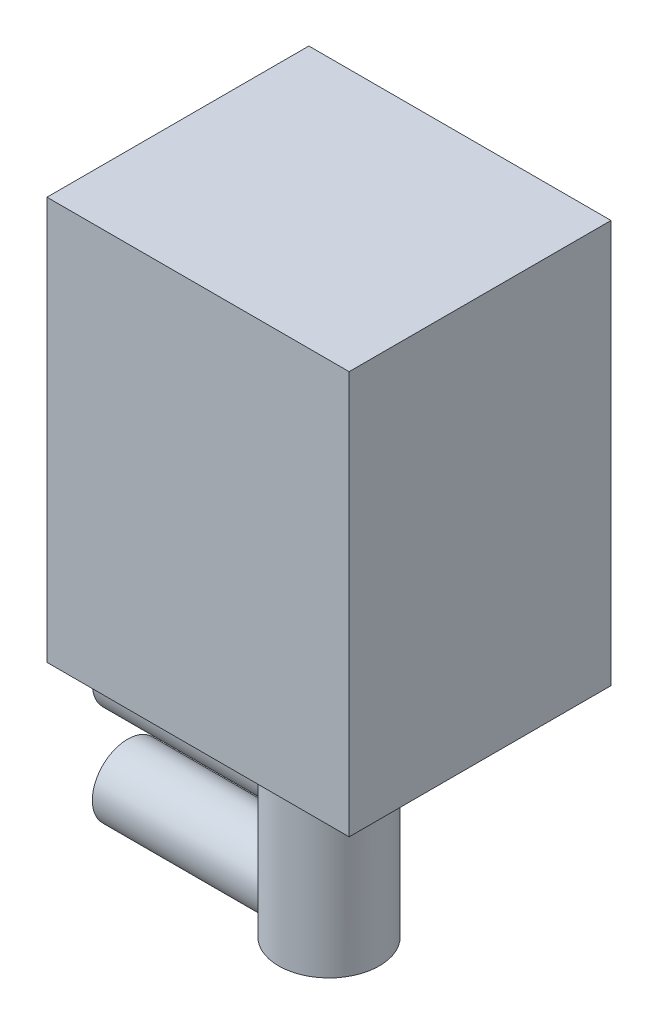
ISO-10303-21;
HEADER;
FILE_DESCRIPTION(('STEP AP214'),'2;1');
FILE_NAME('part.step','',(''),(''),'','','');
FILE_SCHEMA(('AUTOMOTIVE_DESIGN { 1 0 10303 214 1 1 1 1 }'));
ENDSEC;
DATA;
#1=APPLICATION_CONTEXT('core data for automotive mechanical design processes');
#2=APPLICATION_PROTOCOL_DEFINITION('international standard','automotive_design',2000,#1);
#3=PRODUCT_CONTEXT('',#1,'mechanical');
#4=PRODUCT('Part','Part','',(#3));
#5=PRODUCT_RELATED_PRODUCT_CATEGORY('part','',(#4));
#6=PRODUCT_DEFINITION_FORMATION('','',#4);
#7=PRODUCT_DEFINITION_CONTEXT('part definition',#1,'design');
#8=PRODUCT_DEFINITION('design','',#6,#7);
#9=PRODUCT_DEFINITION_SHAPE('','',#8);
#10=(LENGTH_UNIT() NAMED_UNIT(*) SI_UNIT(.MILLI.,.METRE.));
#11=(NAMED_UNIT(*) PLANE_ANGLE_UNIT() SI_UNIT($,.RADIAN.));
#12=(NAMED_UNIT(*) SI_UNIT($,.STERADIAN.) SOLID_ANGLE_UNIT());
#13=UNCERTAINTY_MEASURE_WITH_UNIT(LENGTH_MEASURE(1.E-05),#10,'distance_accuracy_value','');
#14=(GEOMETRIC_REPRESENTATION_CONTEXT(3) GLOBAL_UNCERTAINTY_ASSIGNED_CONTEXT((#13)) GLOBAL_UNIT_ASSIGNED_CONTEXT((#10,
#11,#12)) REPRESENTATION_CONTEXT('',''));
#15=CARTESIAN_POINT('',(0.,0.,0.));
#16=DIRECTION('',(0.,0.,1.));
#17=DIRECTION('',(1.,0.,0.));
#18=AXIS2_PLACEMENT_3D('',#15,#16,#17);
#19=CARTESIAN_POINT('',(0.,0.,13.));
#20=DIRECTION('',(0.,-1.,0.));
#21=DIRECTION('',(0.,0.,-1.));
#22=AXIS2_PLACEMENT_3D('',#19,#20,#21);
#23=PLANE('',#22);
#24=DIRECTION('',(-1.,0.,0.));
#25=VECTOR('',#24,1.);
#26=CARTESIAN_POINT('',(0.,0.,0.));
#27=LINE('',#26,#25);
#28=CARTESIAN_POINT('',(0.,0.,0.));
#29=VERTEX_POINT('',#28);
#30=CARTESIAN_POINT('',(-15.,0.,0.));
#31=VERTEX_POINT('',#30);
#32=EDGE_CURVE('E128',#29,#31,#27,.T.);
#33=ORIENTED_EDGE('',*,*,#32,.T.);
#34=DIRECTION('',(0.,0.,-1.));
#35=VECTOR('',#34,1.);
#36=CARTESIAN_POINT('',(-15.,0.,13.));
#37=LINE('',#36,#35);
#38=CARTESIAN_POINT('',(-15.,0.,13.));
#39=VERTEX_POINT('',#38);
#40=EDGE_CURVE('E59',#39,#31,#37,.T.);
#41=ORIENTED_EDGE('',*,*,#40,.F.);
#42=DIRECTION('',(-1.,0.,0.));
#43=VECTOR('',#42,1.);
#44=CARTESIAN_POINT('',(0.,0.,13.));
#45=LINE('',#44,#43);
#46=CARTESIAN_POINT('',(0.,0.,13.));
#47=VERTEX_POINT('',#46);
#48=EDGE_CURVE('E107',#47,#39,#45,.T.);
#49=ORIENTED_EDGE('',*,*,#48,.F.);
#50=DIRECTION('',(0.,0.,-1.));
#51=VECTOR('',#50,1.);
#52=CARTESIAN_POINT('',(0.,0.,13.));
#53=LINE('',#52,#51);
#54=EDGE_CURVE('E124',#47,#29,#53,.T.);
#55=ORIENTED_EDGE('',*,*,#54,.T.);
#56=EDGE_LOOP('',(#33,#41,#49,#55));
#57=FACE_BOUND('',#56,.T.);
#58=ADVANCED_FACE('F45',(#57),#23,.F.);
#59=CARTESIAN_POINT('',(-15.,0.,13.));
#60=DIRECTION('',(1.,0.,0.));
#61=DIRECTION('',(0.,1.,0.));
#62=AXIS2_PLACEMENT_3D('',#59,#60,#61);
#63=PLANE('',#62);
#64=DIRECTION('',(0.,-1.,0.));
#65=VECTOR('',#64,1.);
#66=CARTESIAN_POINT('',(-15.,0.,0.));
#67=LINE('',#66,#65);
#68=CARTESIAN_POINT('',(-15.,-20.,0.));
#69=VERTEX_POINT('',#68);
#70=EDGE_CURVE('E114',#31,#69,#67,.T.);
#71=ORIENTED_EDGE('',*,*,#70,.T.);
#72=DIRECTION('',(0.,0.,-1.));
#73=VECTOR('',#72,1.);
#74=CARTESIAN_POINT('',(-15.,-20.,13.));
#75=LINE('',#74,#73);
#76=CARTESIAN_POINT('',(-15.,-20.,13.));
#77=VERTEX_POINT('',#76);
#78=EDGE_CURVE('E112',#77,#69,#75,.T.);
#79=ORIENTED_EDGE('',*,*,#78,.F.);
#80=DIRECTION('',(0.,-1.,0.));
#81=VECTOR('',#80,1.);
#82=CARTESIAN_POINT('',(-15.,0.,13.));
#83=LINE('',#82,#81);
#84=EDGE_CURVE('E101',#39,#77,#83,.T.);
#85=ORIENTED_EDGE('',*,*,#84,.F.);
#86=ORIENTED_EDGE('',*,*,#40,.T.);
#87=EDGE_LOOP('',(#71,#79,#85,#86));
#88=FACE_BOUND('',#87,.T.);
#89=ADVANCED_FACE('F113',(#88),#63,.F.);
#90=CARTESIAN_POINT('',(0.,-20.,13.));
#91=DIRECTION('',(0.,1.,0.));
#92=DIRECTION('',(0.,0.,1.));
#93=AXIS2_PLACEMENT_3D('',#90,#91,#92);
#94=PLANE('',#93);
#95=CARTESIAN_POINT('',(-7.5,-20.,6.5));
#96=DIRECTION('',(0.,-1.,0.));
#97=DIRECTION('',(0.,0.,-1.));
#98=AXIS2_PLACEMENT_3D('',#95,#96,#97);
#99=CIRCLE('',#98,2.5);
#100=CARTESIAN_POINT('',(-7.5,-20.,4.));
#101=VERTEX_POINT('',#100);
#102=EDGE_CURVE('E11',#101,#101,#99,.T.);
#103=ORIENTED_EDGE('',*,*,#102,.F.);
#104=EDGE_LOOP('',(#103));
#105=FACE_BOUND('',#104,.T.);
#106=DIRECTION('',(1.,0.,0.));
#107=VECTOR('',#106,1.);
#108=CARTESIAN_POINT('',(0.,-20.,0.));
#109=LINE('',#108,#107);
#110=CARTESIAN_POINT('',(0.,-20.,0.));
#111=VERTEX_POINT('',#110);
#112=EDGE_CURVE('E135',#69,#111,#109,.T.);
#113=ORIENTED_EDGE('',*,*,#112,.T.);
#114=DIRECTION('',(0.,0.,-1.));
#115=VECTOR('',#114,1.);
#116=CARTESIAN_POINT('',(0.,-20.,13.));
#117=LINE('',#116,#115);
#118=CARTESIAN_POINT('',(0.,-20.,13.));
#119=VERTEX_POINT('',#118);
#120=EDGE_CURVE('E118',#119,#111,#117,.T.);
#121=ORIENTED_EDGE('',*,*,#120,.F.);
#122=DIRECTION('',(1.,0.,0.));
#123=VECTOR('',#122,1.);
#124=CARTESIAN_POINT('',(0.,-20.,13.));
#125=LINE('',#124,#123);
#126=EDGE_CURVE('E104',#77,#119,#125,.T.);
#127=ORIENTED_EDGE('',*,*,#126,.F.);
#128=ORIENTED_EDGE('',*,*,#78,.T.);
#129=EDGE_LOOP('',(#113,#121,#127,#128));
#130=FACE_BOUND('',#129,.T.);
#131=ADVANCED_FACE('F120',(#105,#130),#94,.F.);
#132=CARTESIAN_POINT('',(0.,0.,13.));
#133=DIRECTION('',(-1.,0.,0.));
#134=DIRECTION('',(0.,0.,1.));
#135=AXIS2_PLACEMENT_3D('',#132,#133,#134);
#136=PLANE('',#135);
#137=DIRECTION('',(0.,1.,0.));
#138=VECTOR('',#137,1.);
#139=CARTESIAN_POINT('',(0.,0.,0.));
#140=LINE('',#139,#138);
#141=EDGE_CURVE('E93',#111,#29,#140,.T.);
#142=ORIENTED_EDGE('',*,*,#141,.T.);
#143=ORIENTED_EDGE('',*,*,#54,.F.);
#144=DIRECTION('',(0.,1.,0.));
#145=VECTOR('',#144,1.);
#146=CARTESIAN_POINT('',(0.,0.,13.));
#147=LINE('',#146,#145);
#148=EDGE_CURVE('E73',#119,#47,#147,.T.);
#149=ORIENTED_EDGE('',*,*,#148,.F.);
#150=ORIENTED_EDGE('',*,*,#120,.T.);
#151=EDGE_LOOP('',(#142,#143,#149,#150));
#152=FACE_BOUND('',#151,.T.);
#153=ADVANCED_FACE('F148',(#152),#136,.F.);
#154=CARTESIAN_POINT('',(0.,0.,13.));
#155=DIRECTION('',(0.,0.,1.));
#156=DIRECTION('',(1.,0.,0.));
#157=AXIS2_PLACEMENT_3D('',#154,#155,#156);
#158=PLANE('',#157);
#159=ORIENTED_EDGE('',*,*,#48,.T.);
#160=ORIENTED_EDGE('',*,*,#84,.T.);
#161=ORIENTED_EDGE('',*,*,#126,.T.);
#162=ORIENTED_EDGE('',*,*,#148,.T.);
#163=EDGE_LOOP('',(#159,#160,#161,#162));
#164=FACE_BOUND('',#163,.T.);
#165=ADVANCED_FACE('F102',(#164),#158,.T.);
#166=CARTESIAN_POINT('',(0.,0.,0.));
#167=DIRECTION('',(0.,0.,1.));
#168=DIRECTION('',(1.,0.,0.));
#169=AXIS2_PLACEMENT_3D('',#166,#167,#168);
#170=PLANE('',#169);
#171=ORIENTED_EDGE('',*,*,#32,.F.);
#172=ORIENTED_EDGE('',*,*,#141,.F.);
#173=ORIENTED_EDGE('',*,*,#112,.F.);
#174=ORIENTED_EDGE('',*,*,#70,.F.);
#175=EDGE_LOOP('',(#171,#172,#173,#174));
#176=FACE_BOUND('',#175,.T.);
#177=ADVANCED_FACE('F147',(#176),#170,.F.);
#178=CARTESIAN_POINT('',(-7.5,-31.3,6.5));
#179=DIRECTION('',(0.,1.,0.));
#180=DIRECTION('',(0.,0.,1.));
#181=AXIS2_PLACEMENT_3D('',#178,#179,#180);
#182=CYLINDRICAL_SURFACE('',#181,2.5);
#183=CARTESIAN_POINT('',(-9.28535710713571,-24.55,4.75));
#184=CARTESIAN_POINT('',(-9.28536365232842,-24.4659990149189,4.75000331529756));
#185=CARTESIAN_POINT('',(-9.29140301018335,-24.3819795606854,4.75610478790581));
#186=CARTESIAN_POINT('',(-9.31428207856453,-24.217056162701,4.77993289424304));
#187=CARTESIAN_POINT('',(-9.33114580062352,-24.1361595703582,4.79768537521087));
#188=CARTESIAN_POINT('',(-9.37249938059928,-23.9804850639074,4.84329501332473));
#189=CARTESIAN_POINT('',(-9.39690320720833,-23.9056495767931,4.87103873541134));
#190=CARTESIAN_POINT('',(-9.45043473735259,-23.7618668245187,4.9355319573568));
#191=CARTESIAN_POINT('',(-9.47956276982564,-23.6929199698841,4.97228208440633));
#192=CARTESIAN_POINT('',(-9.54535102275824,-23.5496521862624,5.06121378337588));
#193=CARTESIAN_POINT('',(-9.58243700207531,-23.4765046006,5.11497070102416));
#194=CARTESIAN_POINT('',(-9.6564208214175,-23.3392196651729,5.23322154200872));
#195=CARTESIAN_POINT('',(-9.69331837146343,-23.2750935895146,5.29772868381858));
#196=CARTESIAN_POINT('',(-9.76996924261653,-23.1470343277908,5.4485562470379));
#197=CARTESIAN_POINT('',(-9.80917478390817,-23.084911850999,5.53672030976486));
#198=CARTESIAN_POINT('',(-9.87911884375226,-22.9769806528166,5.72549285513386));
#199=CARTESIAN_POINT('',(-9.90987426748605,-22.9311393050336,5.82607589919898));
#200=CARTESIAN_POINT('',(-9.95245937204221,-22.8685052913527,6.00835837879527));
#201=CARTESIAN_POINT('',(-9.96715488574729,-22.8472151002854,6.08785474580114));
#202=CARTESIAN_POINT('',(-9.9888153213972,-22.8159781422621,6.25005814684412));
#203=CARTESIAN_POINT('',(-9.99578641573295,-22.8060223181211,6.33276256262945));
#204=CARTESIAN_POINT('',(-10.0013889313169,-22.7980140881605,6.49919404690065));
#205=CARTESIAN_POINT('',(-10.0000041556763,-22.7999848005762,6.58292278736904));
#206=CARTESIAN_POINT('',(-9.98898580019574,-22.8157619395261,6.74870836762094));
#207=CARTESIAN_POINT('',(-9.97934992009681,-22.8295716665651,6.83076473464534));
#208=CARTESIAN_POINT('',(-9.95297594957067,-22.8678060123417,6.98909167896559));
#209=CARTESIAN_POINT('',(-9.93640494040199,-22.8919812213537,7.06545155447358));
#210=CARTESIAN_POINT('',(-9.8974241748025,-22.949813150594,7.21286612437319));
#211=CARTESIAN_POINT('',(-9.87501327141353,-22.9834717334672,7.28391977308835));
#212=CARTESIAN_POINT('',(-9.82302570425101,-23.0634017717464,7.42736494885482));
#213=CARTESIAN_POINT('',(-9.7929270864848,-23.1106648654039,7.49901153543619));
#214=CARTESIAN_POINT('',(-9.72936304366409,-23.214248105006,7.63380163072984));
#215=CARTESIAN_POINT('',(-9.6958940072484,-23.2705780054192,7.69693584549686));
#216=CARTESIAN_POINT('',(-9.6217040880619,-23.4021316304982,7.82466884852147));
#217=CARTESIAN_POINT('',(-9.58075557422617,-23.4789329950785,7.88751556001384));
#218=CARTESIAN_POINT('',(-9.50128404549408,-23.642924579626,7.99986258412797));
#219=CARTESIAN_POINT('',(-9.46276040583433,-23.7301121067378,8.04936634540833));
#220=CARTESIAN_POINT('',(-9.40133168615619,-23.8928609257998,8.12379387354891));
#221=CARTESIAN_POINT('',(-9.3768757262815,-23.9664379045021,8.1517550759101));
#222=CARTESIAN_POINT('',(-9.33530095032361,-24.1185469367905,8.19783359991294));
#223=CARTESIAN_POINT('',(-9.31816842537048,-24.1970694137189,8.21596933120924));
#224=CARTESIAN_POINT('',(-9.29384395713167,-24.3582900254054,8.2413948338882));
#225=CARTESIAN_POINT('',(-9.28675445152955,-24.4410223971969,8.24857289482399));
#226=CARTESIAN_POINT('',(-9.28434054379133,-24.6068290239285,8.2510385880738));
#227=CARTESIAN_POINT('',(-9.28901185251409,-24.6899031432021,8.24633055521636));
#228=CARTESIAN_POINT('',(-9.30768760487068,-24.8417906902261,8.22696239874667));
#229=CARTESIAN_POINT('',(-9.3203046319629,-24.9109813983149,8.21377642758929));
#230=CARTESIAN_POINT('',(-9.35179990244809,-25.0459618371618,8.179694996125));
#231=CARTESIAN_POINT('',(-9.37068474477724,-25.11174789867,8.15879140787065));
#232=CARTESIAN_POINT('',(-9.42274158237606,-25.2692296517999,8.09852896713014));
#233=CARTESIAN_POINT('',(-9.45845312500197,-25.3585319608095,8.05511505325273));
#234=CARTESIAN_POINT('',(-9.53399599544424,-25.5274271747067,7.9549264851744));
#235=CARTESIAN_POINT('',(-9.57383528916823,-25.6070006345115,7.89812571684052));
#236=CARTESIAN_POINT('',(-9.65418669583295,-25.7571042207913,7.7709251028698));
#237=CARTESIAN_POINT('',(-9.6946973173828,-25.8274353415547,7.70028884551029));
#238=CARTESIAN_POINT('',(-9.77185413151566,-25.9558614848155,7.54691346170575));
#239=CARTESIAN_POINT('',(-9.80850595042205,-26.0139744488824,7.46419238810028));
#240=CARTESIAN_POINT('',(-9.86919526820174,-26.1077685700709,7.30197297783225));
#241=CARTESIAN_POINT('',(-9.89431368424312,-26.1455551930822,7.22410182875262));
#242=CARTESIAN_POINT('',(-9.93747683045928,-26.2096252281767,7.06189989834058));
#243=CARTESIAN_POINT('',(-9.95552585079695,-26.2359156180433,6.97757307199189));
#244=CARTESIAN_POINT('',(-9.98300657254176,-26.275697273114,6.80402634864754));
#245=CARTESIAN_POINT('',(-9.9923884789659,-26.289114595737,6.71478126089729));
#246=CARTESIAN_POINT('',(-10.0013782796574,-26.3019749816737,6.53480553888199));
#247=CARTESIAN_POINT('',(-10.0009899864331,-26.3014234958682,6.44407549788398));
#248=CARTESIAN_POINT('',(-9.99101138192816,-26.2871405074315,6.27309185179121));
#249=CARTESIAN_POINT('',(-9.98231388173467,-26.2746877312971,6.19267308324698));
#250=CARTESIAN_POINT('',(-9.95773771003211,-26.2391238817133,6.03538762375546));
#251=CARTESIAN_POINT('',(-9.94185767243074,-26.2160107806925,5.95852161159616));
#252=CARTESIAN_POINT('',(-9.90344767867576,-26.1591967661347,5.80736995307969));
#253=CARTESIAN_POINT('',(-9.88070436495182,-26.1251534899162,5.73326887163356));
#254=CARTESIAN_POINT('',(-9.83039638985978,-26.0480322058968,5.59175958168727));
#255=CARTESIAN_POINT('',(-9.8028307960369,-26.0049524504459,5.52435267155708));
#256=CARTESIAN_POINT('',(-9.73999116004928,-25.9034754607884,5.38689475395307));
#257=CARTESIAN_POINT('',(-9.70418577912312,-25.8437363820568,5.31807867742173));
#258=CARTESIAN_POINT('',(-9.63102660052163,-25.7147319173632,5.1907501770447));
#259=CARTESIAN_POINT('',(-9.59366969893854,-25.6454467223589,5.13225977115243));
#260=CARTESIAN_POINT('',(-9.51471303450109,-25.4865279944988,5.01795288106144));
#261=CARTESIAN_POINT('',(-9.4733701022534,-25.395407992497,4.96400396927106));
#262=CARTESIAN_POINT('',(-9.39871813385105,-25.2022794940823,4.872622418089));
#263=CARTESIAN_POINT('',(-9.36538488501279,-25.1003051933291,4.83513971060891));
#264=CARTESIAN_POINT('',(-9.32254477153272,-24.9227346912676,4.78857220570044));
#265=CARTESIAN_POINT('',(-9.30880418551828,-24.8495615086463,4.77419594141868));
#266=CARTESIAN_POINT('',(-9.29021518690061,-24.7009276967234,4.75491663148513));
#267=CARTESIAN_POINT('',(-9.28535122655919,-24.6254713027482,4.74999702134653));
#268=CARTESIAN_POINT('',(-9.28535710713571,-24.55,4.75));
#269=B_SPLINE_CURVE_WITH_KNOTS('',3,(#183,#184,#185,#186,#187,#188,#189,#190,#191,#192,#193,
#194,#195,#196,#197,#198,#199,#200,#201,#202,#203,#204,#205,#206,#207,#208,#209,#210,#211,#212,
#213,#214,#215,#216,#217,#218,#219,#220,#221,#222,#223,#224,#225,#226,#227,#228,#229,#230,#231,
#232,#233,#234,#235,#236,#237,#238,#239,#240,#241,#242,#243,#244,#245,#246,#247,#248,#249,#250,
#251,#252,#253,#254,#255,#256,#257,#258,#259,#260,#261,#262,#263,#264,#265,#266,#267,#268),
.UNSPECIFIED.,.T.,.F.,(4,2,2,2,2,2,2,2,2,2,2,2,2,2,2,2,2,2,2,2,2,2,2,2,2,2,2,2,2,2,2,2,2,2,2,2,
2,2,2,2,2,2,4),(0.,0.251644352862943,0.503848863092813,0.753275865950745,1.00272024341801,
1.29584807815702,1.58933903876421,1.93170814842452,2.27338724778376,2.52311133695241,
2.77263573360097,3.02264395964274,3.27272190616391,3.51709337531477,3.76151287536607,
4.03336573621144,4.30551304756613,4.62626324788577,4.94693046648402,5.19332741197632,
5.43926108098983,5.68768561592647,5.93601956414821,6.14983844698567,6.36388316239659,
6.67875939439456,6.99425502444262,7.31570467879083,7.63667895652621,7.90595122268596,
8.17505982302552,8.44570508287669,8.7162447336979,8.9606422999123,9.20508636920796,
9.45808878225994,9.71114017102311,10.003763719812,10.2970038996666,10.6363668560714,
10.9746906604828,11.201179465444,11.427271184743),.UNSPECIFIED.);
#270=CARTESIAN_POINT('',(-9.28535710713571,-24.55,4.75));
#271=VERTEX_POINT('',#270);
#272=EDGE_CURVE('E48',#271,#271,#269,.T.);
#273=ORIENTED_EDGE('',*,*,#272,.T.);
#274=EDGE_LOOP('',(#273));
#275=FACE_BOUND('',#274,.T.);
#276=CARTESIAN_POINT('',(-7.5,-31.3,6.5));
#277=DIRECTION('',(0.,-1.,0.));
#278=DIRECTION('',(0.,0.,-1.));
#279=AXIS2_PLACEMENT_3D('',#276,#277,#278);
#280=CIRCLE('',#279,2.5);
#281=CARTESIAN_POINT('',(-10.,-31.3,6.5));
#282=VERTEX_POINT('',#281);
#283=EDGE_CURVE('E132',#282,#282,#280,.T.);
#284=ORIENTED_EDGE('',*,*,#283,.F.);
#285=CARTESIAN_POINT('',(-10.,-31.3,6.5));
#286=CARTESIAN_POINT('',(-10.0000041793518,-31.3000045149887,6.41297271936934));
#287=CARTESIAN_POINT('',(-9.99541947341674,-31.2934745046267,6.32596867366688));
#288=CARTESIAN_POINT('',(-9.97754380094948,-31.2677916983242,6.15476619801526));
#289=CARTESIAN_POINT('',(-9.96425025749596,-31.2486351662201,6.07056860623991));
#290=CARTESIAN_POINT('',(-9.93024703487298,-31.1989167404495,5.90771895743925));
#291=CARTESIAN_POINT('',(-9.90957325629009,-31.1684100290487,5.82904222373657));
#292=CARTESIAN_POINT('',(-9.86242684544264,-31.0973418517508,5.6783040884717));
#293=CARTESIAN_POINT('',(-9.83595336701337,-31.0567789185571,5.60624365439386));
#294=CARTESIAN_POINT('',(-9.77647320252163,-30.9628938780296,5.46358439536436));
#295=CARTESIAN_POINT('',(-9.74309600217931,-30.9087612712889,5.39367680508403));
#296=CARTESIAN_POINT('',(-9.67394550601552,-30.7912878976944,5.26330284712249));
#297=CARTESIAN_POINT('',(-9.63816866805864,-30.7279333494161,5.20285089564969));
#298=CARTESIAN_POINT('',(-9.56053397834969,-30.5809612662512,5.08218572732036));
#299=CARTESIAN_POINT('',(-9.51871447556133,-30.4957400365666,5.02388835617944));
#300=CARTESIAN_POINT('',(-9.44043963297497,-30.3144942617342,4.92240917658817));
#301=CARTESIAN_POINT('',(-9.40397538152149,-30.218488144673,4.8792020874246));
#302=CARTESIAN_POINT('',(-9.35242205195633,-30.0483173413232,4.82084743471355));
#303=CARTESIAN_POINT('',(-9.33421297133124,-29.9766691292954,4.80115167864097));
#304=CARTESIAN_POINT('',(-9.30575433463996,-29.8299864428518,4.77092796371589));
#305=CARTESIAN_POINT('',(-9.29548920088628,-29.7549589025934,4.76038205751247));
#306=CARTESIAN_POINT('',(-9.28453095722031,-29.6030029710236,4.74913720558147));
#307=CARTESIAN_POINT('',(-9.28389273646174,-29.5260661830345,4.74849472512817));
#308=CARTESIAN_POINT('',(-9.29245352676614,-29.3733032755801,4.75726037839588));
#309=CARTESIAN_POINT('',(-9.3016593036704,-29.2974779563661,4.76667542471356));
#310=CARTESIAN_POINT('',(-9.32745212803341,-29.1540860486982,4.79391274766362));
#311=CARTESIAN_POINT('',(-9.34351175163694,-29.0863047116314,4.81113895595448));
#312=CARTESIAN_POINT('',(-9.38095725913183,-28.9546063382046,4.85294578630148));
#313=CARTESIAN_POINT('',(-9.40234741085843,-28.8906924494863,4.87753230450798));
#314=CARTESIAN_POINT('',(-9.4608517926034,-28.734434826859,4.94818855930399));
#315=CARTESIAN_POINT('',(-9.5002912082621,-28.6449771515981,4.99873799449284));
#316=CARTESIAN_POINT('',(-9.58176917564179,-28.4768375733802,5.11391320470975));
#317=CARTESIAN_POINT('',(-9.62381288681897,-28.3981781228575,5.17856760656791));
#318=CARTESIAN_POINT('',(-9.70659860006416,-28.2518292617579,5.32192495247513));
#319=CARTESIAN_POINT('',(-9.7473191521764,-28.184281566013,5.40078595001918));
#320=CARTESIAN_POINT('',(-9.82285537425777,-28.0632641874956,5.5710363118226));
#321=CARTESIAN_POINT('',(-9.85768323048681,-28.0097653215744,5.66239909591276));
#322=CARTESIAN_POINT('',(-9.91108315956312,-27.9293497927609,5.83448326031656));
#323=CARTESIAN_POINT('',(-9.93154675521246,-27.8991713261281,5.91309338109204));
#324=CARTESIAN_POINT('',(-9.96505005792205,-27.8502077843235,6.07530409068576));
#325=CARTESIAN_POINT('',(-9.97809482110888,-27.8314149489772,6.15890123768187));
#326=CARTESIAN_POINT('',(-9.99563204406047,-27.8062218497902,6.32919920884718));
#327=CARTESIAN_POINT('',(-10.0000898023534,-27.7998718677538,6.41591118983029));
#328=CARTESIAN_POINT('',(-9.99990747395293,-27.8001320232454,6.58930773888807));
#329=CARTESIAN_POINT('',(-9.99526779830962,-27.8067415752218,6.6759923080243));
#330=CARTESIAN_POINT('',(-9.97794154123151,-27.8316385857341,6.84093934552624));
#331=CARTESIAN_POINT('',(-9.96579983422277,-27.8491358331591,6.91938227091176));
#332=CARTESIAN_POINT('',(-9.9349433696278,-27.8941866503338,7.07193808705765));
#333=CARTESIAN_POINT('',(-9.91622738595171,-27.9217420959554,7.14605016711457));
#334=CARTESIAN_POINT('',(-9.87201203552655,-27.988079257212,7.29366900007704));
#335=CARTESIAN_POINT('',(-9.84612667674836,-28.0275168609928,7.36676261903873));
#336=CARTESIAN_POINT('',(-9.7900912341195,-28.1153702705986,7.50553102651501));
#337=CARTESIAN_POINT('',(-9.75993847260895,-28.1637917194789,7.57120111010224));
#338=CARTESIAN_POINT('',(-9.69186051249632,-28.2775302087342,7.7051169544116));
#339=CARTESIAN_POINT('',(-9.65348779684155,-28.3443204867347,7.77188389332647));
#340=CARTESIAN_POINT('',(-9.57659509979641,-28.4877286042172,7.8938990473957));
#341=CARTESIAN_POINT('',(-9.53807502611855,-28.5643541541214,7.94913813503907));
#342=CARTESIAN_POINT('',(-9.46818423916184,-28.7190112651081,8.04250374053234));
#343=CARTESIAN_POINT('',(-9.43648212076273,-28.7962062840651,8.08176211114096));
#344=CARTESIAN_POINT('',(-9.37957574711101,-28.95757761454,8.14898119692594));
#345=CARTESIAN_POINT('',(-9.354358830637,-29.0417398922286,8.1769639872125));
#346=CARTESIAN_POINT('',(-9.31845300156846,-29.1981172855446,8.21574655060216));
#347=CARTESIAN_POINT('',(-9.30585711808347,-29.2693051236333,8.22887719728624));
#348=CARTESIAN_POINT('',(-9.28912258576231,-29.4137067088704,8.24619415538159));
#349=CARTESIAN_POINT('',(-9.28497297565372,-29.4869177051382,8.25039205970941));
#350=CARTESIAN_POINT('',(-9.28579858784421,-29.633320099052,8.24954943123305));
#351=CARTESIAN_POINT('',(-9.29078477427084,-29.7065113675771,8.24449779780214));
#352=CARTESIAN_POINT('',(-9.30908240910004,-29.8507017225225,8.22551030533985));
#353=CARTESIAN_POINT('',(-9.32240601491834,-29.921697448532,8.21156147206044));
#354=CARTESIAN_POINT('',(-9.36023331257332,-30.0795230514212,8.1704809527878));
#355=CARTESIAN_POINT('',(-9.38683222043297,-30.1651591842471,8.14073809905304));
#356=CARTESIAN_POINT('',(-9.44640956515885,-30.3290225466749,8.06959792590754));
#357=CARTESIAN_POINT('',(-9.47939789114784,-30.4072380078033,8.02818249462832));
#358=CARTESIAN_POINT('',(-9.54891130247936,-30.5575078345548,7.93369647433306));
#359=CARTESIAN_POINT('',(-9.58550185606104,-30.6293713658863,7.88037205396872));
#360=CARTESIAN_POINT('',(-9.65840763229012,-30.7642649919782,7.76334356222077));
#361=CARTESIAN_POINT('',(-9.6947227597007,-30.8272921522287,7.69963605778967));
#362=CARTESIAN_POINT('',(-9.77079131160559,-30.9542912804869,7.54967102347161));
#363=CARTESIAN_POINT('',(-9.80994878795956,-31.0163052410749,7.46142109045168));
#364=CARTESIAN_POINT('',(-9.87979805490241,-31.1240443214951,7.27244010458688));
#365=CARTESIAN_POINT('',(-9.91049971586718,-31.1697884512521,7.17172380443665));
#366=CARTESIAN_POINT('',(-9.95586784186853,-31.2365011560205,6.97663613293077));
#367=CARTESIAN_POINT('',(-9.97225293880968,-31.2601635271712,6.88359369561103));
#368=CARTESIAN_POINT('',(-9.99430986262131,-31.2919004993204,6.69368789529509));
#369=CARTESIAN_POINT('',(-9.99999534990845,-31.2999949764672,6.59682956574038));
#370=CARTESIAN_POINT('',(-10.,-31.3,6.5));
#371=B_SPLINE_CURVE_WITH_KNOTS('',3,(#285,#286,#287,#288,#289,#290,#291,#292,#293,#294,#295,
#296,#297,#298,#299,#300,#301,#302,#303,#304,#305,#306,#307,#308,#309,#310,#311,#312,#313,#314,
#315,#316,#317,#318,#319,#320,#321,#322,#323,#324,#325,#326,#327,#328,#329,#330,#331,#332,#333,
#334,#335,#336,#337,#338,#339,#340,#341,#342,#343,#344,#345,#346,#347,#348,#349,#350,#351,#352,
#353,#354,#355,#356,#357,#358,#359,#360,#361,#362,#363,#364,#365,#366,#367,#368,#369,#370),
.UNSPECIFIED.,.T.,.F.,(4,2,2,2,2,2,2,2,2,2,2,2,2,2,2,2,2,2,2,2,2,2,2,2,2,2,2,2,2,2,2,2,2,2,2,2,
2,2,2,2,2,2,4),(0.,0.260691779269078,0.521460731389292,0.78097810136216,1.04053335965115,
1.32301333452968,1.605919870734,1.93863463581597,2.27078930038452,2.49943939217371,
2.72763996822686,2.95714117224209,3.18680021531933,3.40129749690536,3.61596706851561,
3.94441405320527,4.27353394611448,4.60657119588279,4.93891106625194,5.19779533293351,
5.45650295119185,5.71625387326352,5.97599305926016,6.21878245878816,6.46161716213052,
6.72161784328112,6.98178239593967,7.28642204868668,7.5913020011637,7.86700091099149,
8.14215740932881,8.36165195383567,8.580861464063,8.80033422615652,9.0201277660656,
9.30202193352865,9.58435593596872,9.87340651252976,10.162552854955,10.5048761847685,
10.8467982144163,11.1372239593291,11.4272786593702),.UNSPECIFIED.);
#372=EDGE_CURVE('E65',#282,#282,#371,.T.);
#373=ORIENTED_EDGE('',*,*,#372,.T.);
#374=EDGE_LOOP('',(#284,#373));
#375=FACE_BOUND('',#374,.T.);
#376=ORIENTED_EDGE('',*,*,#102,.T.);
#377=EDGE_LOOP('',(#376));
#378=FACE_BOUND('',#377,.T.);
#379=ADVANCED_FACE('F163',(#275,#375,#378),#182,.T.);
#380=CARTESIAN_POINT('',(-7.5,-31.3,6.5));
#381=DIRECTION('',(0.,-1.,0.));
#382=DIRECTION('',(0.,0.,-1.));
#383=AXIS2_PLACEMENT_3D('',#380,#381,#382);
#384=PLANE('',#383);
#385=ORIENTED_EDGE('',*,*,#283,.T.);
#386=EDGE_LOOP('',(#385));
#387=FACE_BOUND('',#386,.T.);
#388=ADVANCED_FACE('F178',(#387),#384,.T.);
#389=CARTESIAN_POINT('',(-17.5,-24.55,6.5));
#390=DIRECTION('',(1.,0.,0.));
#391=DIRECTION('',(0.,0.,-1.));
#392=AXIS2_PLACEMENT_3D('',#389,#390,#391);
#393=CYLINDRICAL_SURFACE('',#392,1.75);
#394=CARTESIAN_POINT('',(-17.5,-24.55,6.5));
#395=DIRECTION('',(1.,0.,0.));
#396=DIRECTION('',(0.,0.,-1.));
#397=AXIS2_PLACEMENT_3D('',#394,#395,#396);
#398=CIRCLE('',#397,1.75);
#399=CARTESIAN_POINT('',(-17.5,-24.55,4.75));
#400=VERTEX_POINT('',#399);
#401=EDGE_CURVE('E161',#400,#400,#398,.T.);
#402=ORIENTED_EDGE('',*,*,#401,.T.);
#403=EDGE_LOOP('',(#402));
#404=FACE_BOUND('',#403,.T.);
#405=ORIENTED_EDGE('',*,*,#272,.F.);
#406=EDGE_LOOP('',(#405));
#407=FACE_BOUND('',#406,.T.);
#408=ADVANCED_FACE('F174',(#404,#407),#393,.T.);
#409=CARTESIAN_POINT('',(-17.5,-24.55,6.5));
#410=DIRECTION('',(1.,0.,0.));
#411=DIRECTION('',(0.,0.,-1.));
#412=AXIS2_PLACEMENT_3D('',#409,#410,#411);
#413=PLANE('',#412);
#414=ORIENTED_EDGE('',*,*,#401,.F.);
#415=EDGE_LOOP('',(#414));
#416=FACE_BOUND('',#415,.T.);
#417=ADVANCED_FACE('F172',(#416),#413,.F.);
#418=CARTESIAN_POINT('',(-17.5,-29.55,6.5));
#419=DIRECTION('',(1.,0.,0.));
#420=DIRECTION('',(0.,0.,-1.));
#421=AXIS2_PLACEMENT_3D('',#418,#419,#420);
#422=CYLINDRICAL_SURFACE('',#421,1.75);
#423=CARTESIAN_POINT('',(-17.5,-29.55,6.5));
#424=DIRECTION('',(1.,0.,0.));
#425=DIRECTION('',(0.,0.,-1.));
#426=AXIS2_PLACEMENT_3D('',#423,#424,#425);
#427=CIRCLE('',#426,1.75);
#428=CARTESIAN_POINT('',(-17.5,-29.55,4.75));
#429=VERTEX_POINT('',#428);
#430=EDGE_CURVE('E160',#429,#429,#427,.T.);
#431=ORIENTED_EDGE('',*,*,#430,.T.);
#432=EDGE_LOOP('',(#431));
#433=FACE_BOUND('',#432,.T.);
#434=ORIENTED_EDGE('',*,*,#372,.F.);
#435=EDGE_LOOP('',(#434));
#436=FACE_BOUND('',#435,.T.);
#437=ADVANCED_FACE('F167',(#433,#436),#422,.T.);
#438=CARTESIAN_POINT('',(-17.5,-29.55,6.5));
#439=DIRECTION('',(1.,0.,0.));
#440=DIRECTION('',(0.,0.,-1.));
#441=AXIS2_PLACEMENT_3D('',#438,#439,#440);
#442=PLANE('',#441);
#443=ORIENTED_EDGE('',*,*,#430,.F.);
#444=EDGE_LOOP('',(#443));
#445=FACE_BOUND('',#444,.T.);
#446=ADVANCED_FACE('F171',(#445),#442,.F.);
#447=CLOSED_SHELL('',(#58,#89,#131,#153,#165,#177,#379,#388,#408,#417,#437,#446));
#448=MANIFOLD_SOLID_BREP('B2',#447);
#449=ADVANCED_BREP_SHAPE_REPRESENTATION('',(#18,#448),#14);
#450=SHAPE_DEFINITION_REPRESENTATION(#9,#449);
ENDSEC;
END-ISO-10303-21;
